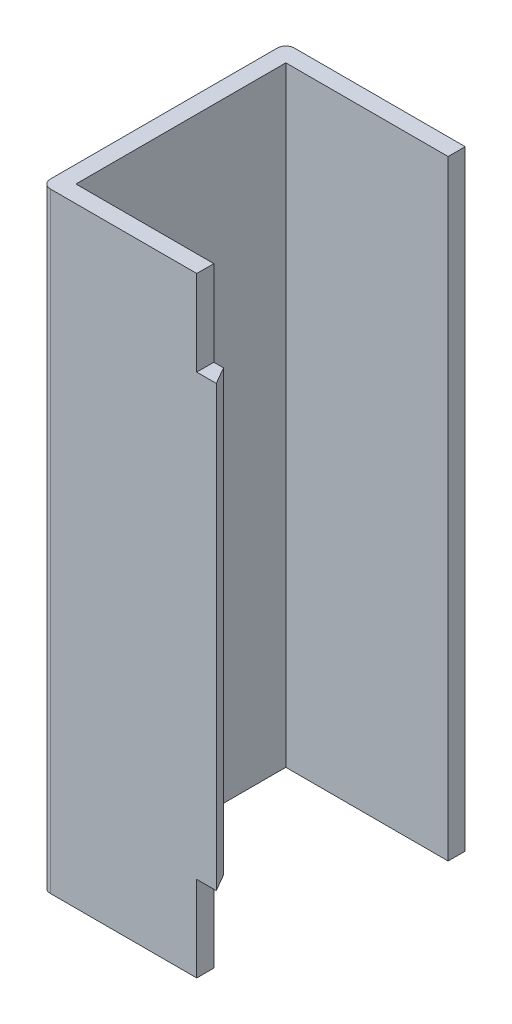
ISO-10303-21;
HEADER;
FILE_DESCRIPTION(('STEP AP214'),'2;1');
FILE_NAME('part.step','',(''),(''),'','','');
FILE_SCHEMA(('AUTOMOTIVE_DESIGN { 1 0 10303 214 1 1 1 1 }'));
ENDSEC;
DATA;
#1=APPLICATION_CONTEXT('core data for automotive mechanical design processes');
#2=APPLICATION_PROTOCOL_DEFINITION('international standard','automotive_design',2000,#1);
#3=PRODUCT_CONTEXT('',#1,'mechanical');
#4=PRODUCT('Part','Part','',(#3));
#5=PRODUCT_RELATED_PRODUCT_CATEGORY('part','',(#4));
#6=PRODUCT_DEFINITION_FORMATION('','',#4);
#7=PRODUCT_DEFINITION_CONTEXT('part definition',#1,'design');
#8=PRODUCT_DEFINITION('design','',#6,#7);
#9=PRODUCT_DEFINITION_SHAPE('','',#8);
#10=(LENGTH_UNIT() NAMED_UNIT(*) SI_UNIT(.MILLI.,.METRE.));
#11=(NAMED_UNIT(*) PLANE_ANGLE_UNIT() SI_UNIT($,.RADIAN.));
#12=(NAMED_UNIT(*) SI_UNIT($,.STERADIAN.) SOLID_ANGLE_UNIT());
#13=UNCERTAINTY_MEASURE_WITH_UNIT(LENGTH_MEASURE(1.E-05),#10,'distance_accuracy_value','');
#14=(GEOMETRIC_REPRESENTATION_CONTEXT(3) GLOBAL_UNCERTAINTY_ASSIGNED_CONTEXT((#13)) GLOBAL_UNIT_ASSIGNED_CONTEXT((#10,
#11,#12)) REPRESENTATION_CONTEXT('',''));
#15=CARTESIAN_POINT('',(0.,0.,0.));
#16=DIRECTION('',(0.,0.,1.));
#17=DIRECTION('',(1.,0.,0.));
#18=AXIS2_PLACEMENT_3D('',#15,#16,#17);
#19=CARTESIAN_POINT('',(-0.6825,-0.45,0.465));
#20=DIRECTION('',(0.,-1.,0.));
#21=DIRECTION('',(0.,0.,-1.));
#22=AXIS2_PLACEMENT_3D('',#19,#20,#21);
#23=PLANE('',#22);
#24=DIRECTION('',(0.50000000000019,0.,0.866025403784329));
#25=VECTOR('',#24,1.);
#26=CARTESIAN_POINT('',(-0.6425,-0.45,0.5));
#27=LINE('',#26,#25);
#28=CARTESIAN_POINT('',(-0.662707259421912,-0.45,0.464999999999949));
#29=VERTEX_POINT('',#28);
#30=CARTESIAN_POINT('',(-0.6425,-0.45,0.5));
#31=VERTEX_POINT('',#30);
#32=EDGE_CURVE('E115',#29,#31,#27,.T.);
#33=ORIENTED_EDGE('',*,*,#32,.T.);
#34=DIRECTION('',(1.,0.,0.));
#35=VECTOR('',#34,1.);
#36=CARTESIAN_POINT('',(-0.816902515723,-0.45,0.5));
#37=LINE('',#36,#35);
#38=CARTESIAN_POINT('',(-0.6825,-0.45,0.5));
#39=VERTEX_POINT('',#38);
#40=EDGE_CURVE('E176',#39,#31,#37,.T.);
#41=ORIENTED_EDGE('',*,*,#40,.F.);
#42=DIRECTION('',(0.,0.,1.));
#43=VECTOR('',#42,1.);
#44=CARTESIAN_POINT('',(-0.6825,-0.45,0.4825));
#45=LINE('',#44,#43);
#46=CARTESIAN_POINT('',(-0.6825,-0.45,0.465));
#47=VERTEX_POINT('',#46);
#48=EDGE_CURVE('E177',#47,#39,#45,.T.);
#49=ORIENTED_EDGE('',*,*,#48,.F.);
#50=DIRECTION('',(1.,0.,0.));
#51=VECTOR('',#50,1.);
#52=CARTESIAN_POINT('',(-0.808201510334,-0.45,0.465));
#53=LINE('',#52,#51);
#54=EDGE_CURVE('E120',#29,#47,#53,.F.);
#55=ORIENTED_EDGE('',*,*,#54,.F.);
#56=EDGE_LOOP('',(#33,#41,#49,#55));
#57=FACE_BOUND('',#56,.T.);
#58=ADVANCED_FACE('F16',(#57),#23,.T.);
#59=CARTESIAN_POINT('',(-0.6425,-0.45,0.5));
#60=DIRECTION('',(-0.866025403784329,0.,0.50000000000019));
#61=DIRECTION('',(0.50000000000019,0.,0.866025403784329));
#62=AXIS2_PLACEMENT_3D('',#59,#60,#61);
#63=PLANE('',#62);
#64=DIRECTION('',(0.,1.,0.));
#65=VECTOR('',#64,1.);
#66=CARTESIAN_POINT('',(-0.662707259422,0.,0.465));
#67=LINE('',#66,#65);
#68=CARTESIAN_POINT('',(-0.662707259421956,0.45,0.465));
#69=VERTEX_POINT('',#68);
#70=EDGE_CURVE('E270',#69,#29,#67,.F.);
#71=ORIENTED_EDGE('',*,*,#70,.F.);
#72=DIRECTION('',(-0.500000000006741,0.,-0.866025403780547));
#73=VECTOR('',#72,1.);
#74=CARTESIAN_POINT('',(-0.6425,0.45,0.5));
#75=LINE('',#74,#73);
#76=CARTESIAN_POINT('',(-0.6425,0.45,0.5));
#77=VERTEX_POINT('',#76);
#78=EDGE_CURVE('E246',#77,#69,#75,.T.);
#79=ORIENTED_EDGE('',*,*,#78,.F.);
#80=DIRECTION('',(0.,-1.,0.));
#81=VECTOR('',#80,1.);
#82=CARTESIAN_POINT('',(-0.6425,0.,0.5));
#83=LINE('',#82,#81);
#84=EDGE_CURVE('E250',#31,#77,#83,.F.);
#85=ORIENTED_EDGE('',*,*,#84,.F.);
#86=ORIENTED_EDGE('',*,*,#32,.F.);
#87=EDGE_LOOP('',(#71,#79,#85,#86));
#88=FACE_BOUND('',#87,.T.);
#89=ADVANCED_FACE('F428',(#88),#63,.F.);
#90=CARTESIAN_POINT('',(-0.6825,0.45,0.5));
#91=DIRECTION('',(0.,1.,0.));
#92=DIRECTION('',(0.,0.,1.));
#93=AXIS2_PLACEMENT_3D('',#90,#91,#92);
#94=PLANE('',#93);
#95=ORIENTED_EDGE('',*,*,#78,.T.);
#96=DIRECTION('',(1.,0.,0.));
#97=VECTOR('',#96,1.);
#98=CARTESIAN_POINT('',(-0.808201510334,0.45,0.465));
#99=LINE('',#98,#97);
#100=CARTESIAN_POINT('',(-0.6825,0.45,0.465));
#101=VERTEX_POINT('',#100);
#102=EDGE_CURVE('E274',#101,#69,#99,.T.);
#103=ORIENTED_EDGE('',*,*,#102,.F.);
#104=DIRECTION('',(0.,0.,1.));
#105=VECTOR('',#104,1.);
#106=CARTESIAN_POINT('',(-0.6825,0.45,0.4825));
#107=LINE('',#106,#105);
#108=CARTESIAN_POINT('',(-0.6825,0.45,0.5));
#109=VERTEX_POINT('',#108);
#110=EDGE_CURVE('E226',#109,#101,#107,.F.);
#111=ORIENTED_EDGE('',*,*,#110,.F.);
#112=DIRECTION('',(1.,0.,0.));
#113=VECTOR('',#112,1.);
#114=CARTESIAN_POINT('',(-0.816902515723,0.45,0.5));
#115=LINE('',#114,#113);
#116=EDGE_CURVE('E141',#77,#109,#115,.F.);
#117=ORIENTED_EDGE('',*,*,#116,.F.);
#118=EDGE_LOOP('',(#95,#103,#111,#117));
#119=FACE_BOUND('',#118,.T.);
#120=ADVANCED_FACE('F420',(#119),#94,.T.);
#121=CARTESIAN_POINT('',(-0.6825,0.,0.4825));
#122=DIRECTION('',(1.,0.,0.));
#123=DIRECTION('',(0.,1.,0.));
#124=AXIS2_PLACEMENT_3D('',#121,#122,#123);
#125=PLANE('',#124);
#126=DIRECTION('',(0.,0.,1.));
#127=VECTOR('',#126,1.);
#128=CARTESIAN_POINT('',(-0.6825,0.625,0.239822058945));
#129=LINE('',#128,#127);
#130=CARTESIAN_POINT('',(-0.6825,0.625,0.5));
#131=VERTEX_POINT('',#130);
#132=CARTESIAN_POINT('',(-0.6825,0.625,0.465));
#133=VERTEX_POINT('',#132);
#134=EDGE_CURVE('E146',#131,#133,#129,.F.);
#135=ORIENTED_EDGE('',*,*,#134,.F.);
#136=DIRECTION('',(0.,-1.,0.));
#137=VECTOR('',#136,1.);
#138=CARTESIAN_POINT('',(-0.6825,0.,0.5));
#139=LINE('',#138,#137);
#140=EDGE_CURVE('E132',#109,#131,#139,.F.);
#141=ORIENTED_EDGE('',*,*,#140,.F.);
#142=ORIENTED_EDGE('',*,*,#110,.T.);
#143=DIRECTION('',(0.,1.,0.));
#144=VECTOR('',#143,1.);
#145=CARTESIAN_POINT('',(-0.6825,0.,0.465));
#146=LINE('',#145,#144);
#147=EDGE_CURVE('E149',#133,#101,#146,.F.);
#148=ORIENTED_EDGE('',*,*,#147,.F.);
#149=EDGE_LOOP('',(#135,#141,#142,#148));
#150=FACE_BOUND('',#149,.T.);
#151=ADVANCED_FACE('F147',(#150),#125,.T.);
#152=CARTESIAN_POINT('',(-0.6325,0.625,0.));
#153=DIRECTION('',(0.,0.,-1.));
#154=DIRECTION('',(-1.,0.,0.));
#155=AXIS2_PLACEMENT_3D('',#152,#153,#154);
#156=PLANE('',#155);
#157=DIRECTION('',(1.,0.,0.));
#158=VECTOR('',#157,1.);
#159=CARTESIAN_POINT('',(-0.880177932085,-0.625,0.));
#160=LINE('',#159,#158);
#161=CARTESIAN_POINT('',(-0.9825,-0.625,0.));
#162=VERTEX_POINT('',#161);
#163=CARTESIAN_POINT('',(-0.6325,-0.625,0.));
#164=VERTEX_POINT('',#163);
#165=EDGE_CURVE('E222',#162,#164,#160,.T.);
#166=ORIENTED_EDGE('',*,*,#165,.F.);
#167=DIRECTION('',(0.,-1.,0.));
#168=VECTOR('',#167,1.);
#169=CARTESIAN_POINT('',(-0.9825,0.625,0.));
#170=LINE('',#169,#168);
#171=CARTESIAN_POINT('',(-0.9825,0.625,0.));
#172=VERTEX_POINT('',#171);
#173=EDGE_CURVE('E58',#162,#172,#170,.F.);
#174=ORIENTED_EDGE('',*,*,#173,.T.);
#175=DIRECTION('',(1.,0.,0.));
#176=VECTOR('',#175,1.);
#177=CARTESIAN_POINT('',(-0.880177932085,0.625,0.));
#178=LINE('',#177,#176);
#179=CARTESIAN_POINT('',(-0.6325,0.625,0.));
#180=VERTEX_POINT('',#179);
#181=EDGE_CURVE('E158',#180,#172,#178,.F.);
#182=ORIENTED_EDGE('',*,*,#181,.F.);
#183=DIRECTION('',(0.,1.,0.));
#184=VECTOR('',#183,1.);
#185=CARTESIAN_POINT('',(-0.6325,0.,0.));
#186=LINE('',#185,#184);
#187=EDGE_CURVE('E217',#180,#164,#186,.F.);
#188=ORIENTED_EDGE('',*,*,#187,.T.);
#189=EDGE_LOOP('',(#166,#174,#182,#188));
#190=FACE_BOUND('',#189,.T.);
#191=ADVANCED_FACE('F404',(#190),#156,.T.);
#192=CARTESIAN_POINT('',(-0.6325,0.,0.0175));
#193=DIRECTION('',(-1.,0.,0.));
#194=DIRECTION('',(0.,0.,1.));
#195=AXIS2_PLACEMENT_3D('',#192,#193,#194);
#196=PLANE('',#195);
#197=ORIENTED_EDGE('',*,*,#187,.F.);
#198=DIRECTION('',(0.,0.,1.));
#199=VECTOR('',#198,1.);
#200=CARTESIAN_POINT('',(-0.6325,0.625,0.239822058945));
#201=LINE('',#200,#199);
#202=CARTESIAN_POINT('',(-0.6325,0.625,0.035));
#203=VERTEX_POINT('',#202);
#204=EDGE_CURVE('E160',#203,#180,#201,.F.);
#205=ORIENTED_EDGE('',*,*,#204,.F.);
#206=DIRECTION('',(0.,1.,0.));
#207=VECTOR('',#206,1.);
#208=CARTESIAN_POINT('',(-0.6325,-0.625,0.035));
#209=LINE('',#208,#207);
#210=CARTESIAN_POINT('',(-0.6325,-0.625,0.035));
#211=VERTEX_POINT('',#210);
#212=EDGE_CURVE('E208',#211,#203,#209,.T.);
#213=ORIENTED_EDGE('',*,*,#212,.F.);
#214=DIRECTION('',(0.,0.,-1.));
#215=VECTOR('',#214,1.);
#216=CARTESIAN_POINT('',(-0.6325,-0.625,0.239822058945));
#217=LINE('',#216,#215);
#218=EDGE_CURVE('E213',#164,#211,#217,.F.);
#219=ORIENTED_EDGE('',*,*,#218,.F.);
#220=EDGE_LOOP('',(#197,#205,#213,#219));
#221=FACE_BOUND('',#220,.T.);
#222=ADVANCED_FACE('F395',(#221),#196,.F.);
#223=CARTESIAN_POINT('',(-0.6325,-0.625,0.035));
#224=DIRECTION('',(0.,0.,1.));
#225=DIRECTION('',(1.,0.,0.));
#226=AXIS2_PLACEMENT_3D('',#223,#224,#225);
#227=PLANE('',#226);
#228=DIRECTION('',(1.,0.,0.));
#229=VECTOR('',#228,1.);
#230=CARTESIAN_POINT('',(-0.880177932085,0.625,0.035));
#231=LINE('',#230,#229);
#232=CARTESIAN_POINT('',(-0.965,0.625,0.035));
#233=VERTEX_POINT('',#232);
#234=EDGE_CURVE('E143',#233,#203,#231,.T.);
#235=ORIENTED_EDGE('',*,*,#234,.F.);
#236=DIRECTION('',(0.,1.,0.));
#237=VECTOR('',#236,1.);
#238=CARTESIAN_POINT('',(-0.965,-0.625,0.035));
#239=LINE('',#238,#237);
#240=CARTESIAN_POINT('',(-0.965,-0.625,0.035));
#241=VERTEX_POINT('',#240);
#242=EDGE_CURVE('E198',#241,#233,#239,.T.);
#243=ORIENTED_EDGE('',*,*,#242,.F.);
#244=DIRECTION('',(1.,0.,0.));
#245=VECTOR('',#244,1.);
#246=CARTESIAN_POINT('',(-0.880177932085,-0.625,0.035));
#247=LINE('',#246,#245);
#248=EDGE_CURVE('E203',#211,#241,#247,.F.);
#249=ORIENTED_EDGE('',*,*,#248,.F.);
#250=ORIENTED_EDGE('',*,*,#212,.T.);
#251=EDGE_LOOP('',(#235,#243,#249,#250));
#252=FACE_BOUND('',#251,.T.);
#253=ADVANCED_FACE('F386',(#252),#227,.T.);
#254=CARTESIAN_POINT('',(-0.965,-0.625,0.0175));
#255=DIRECTION('',(1.,0.,0.));
#256=DIRECTION('',(0.,1.,0.));
#257=AXIS2_PLACEMENT_3D('',#254,#255,#256);
#258=PLANE('',#257);
#259=DIRECTION('',(0.,0.,1.));
#260=VECTOR('',#259,1.);
#261=CARTESIAN_POINT('',(-0.965,0.625,0.239822058945));
#262=LINE('',#261,#260);
#263=CARTESIAN_POINT('',(-0.965,0.625,0.465));
#264=VERTEX_POINT('',#263);
#265=EDGE_CURVE('E172',#264,#233,#262,.F.);
#266=ORIENTED_EDGE('',*,*,#265,.F.);
#267=DIRECTION('',(0.,1.,0.));
#268=VECTOR('',#267,1.);
#269=CARTESIAN_POINT('',(-0.965,0.,0.465));
#270=LINE('',#269,#268);
#271=CARTESIAN_POINT('',(-0.965,-0.625,0.465));
#272=VERTEX_POINT('',#271);
#273=EDGE_CURVE('E67',#272,#264,#270,.T.);
#274=ORIENTED_EDGE('',*,*,#273,.F.);
#275=DIRECTION('',(0.,0.,-1.));
#276=VECTOR('',#275,1.);
#277=CARTESIAN_POINT('',(-0.965,-0.625,0.239822058945));
#278=LINE('',#277,#276);
#279=EDGE_CURVE('E194',#241,#272,#278,.F.);
#280=ORIENTED_EDGE('',*,*,#279,.F.);
#281=ORIENTED_EDGE('',*,*,#242,.T.);
#282=EDGE_LOOP('',(#266,#274,#280,#281));
#283=FACE_BOUND('',#282,.T.);
#284=ADVANCED_FACE('F378',(#283),#258,.T.);
#285=CARTESIAN_POINT('',(-0.808201510334,0.,0.465));
#286=DIRECTION('',(0.,0.,-1.));
#287=DIRECTION('',(0.,1.,0.));
#288=AXIS2_PLACEMENT_3D('',#285,#286,#287);
#289=PLANE('',#288);
#290=ORIENTED_EDGE('',*,*,#54,.T.);
#291=DIRECTION('',(0.,1.,0.));
#292=VECTOR('',#291,1.);
#293=CARTESIAN_POINT('',(-0.6825,0.,0.465));
#294=LINE('',#293,#292);
#295=CARTESIAN_POINT('',(-0.6825,-0.625,0.465));
#296=VERTEX_POINT('',#295);
#297=EDGE_CURVE('E187',#296,#47,#294,.T.);
#298=ORIENTED_EDGE('',*,*,#297,.F.);
#299=DIRECTION('',(1.,0.,0.));
#300=VECTOR('',#299,1.);
#301=CARTESIAN_POINT('',(-0.880177932085,-0.625,0.465));
#302=LINE('',#301,#300);
#303=EDGE_CURVE('E184',#272,#296,#302,.T.);
#304=ORIENTED_EDGE('',*,*,#303,.F.);
#305=ORIENTED_EDGE('',*,*,#273,.T.);
#306=DIRECTION('',(1.,0.,0.));
#307=VECTOR('',#306,1.);
#308=CARTESIAN_POINT('',(-0.880177932085,0.625,0.465));
#309=LINE('',#308,#307);
#310=EDGE_CURVE('E152',#133,#264,#309,.F.);
#311=ORIENTED_EDGE('',*,*,#310,.F.);
#312=ORIENTED_EDGE('',*,*,#147,.T.);
#313=ORIENTED_EDGE('',*,*,#102,.T.);
#314=ORIENTED_EDGE('',*,*,#70,.T.);
#315=EDGE_LOOP('',(#290,#298,#304,#305,#311,#312,#313,#314));
#316=FACE_BOUND('',#315,.T.);
#317=ADVANCED_FACE('F369',(#316),#289,.T.);
#318=CARTESIAN_POINT('',(-0.6825,0.,0.4825));
#319=DIRECTION('',(1.,0.,0.));
#320=DIRECTION('',(0.,1.,0.));
#321=AXIS2_PLACEMENT_3D('',#318,#319,#320);
#322=PLANE('',#321);
#323=ORIENTED_EDGE('',*,*,#48,.T.);
#324=DIRECTION('',(0.,-1.,0.));
#325=VECTOR('',#324,1.);
#326=CARTESIAN_POINT('',(-0.6825,0.,0.5));
#327=LINE('',#326,#325);
#328=CARTESIAN_POINT('',(-0.6825,-0.625,0.5));
#329=VERTEX_POINT('',#328);
#330=EDGE_CURVE('E173',#329,#39,#327,.F.);
#331=ORIENTED_EDGE('',*,*,#330,.F.);
#332=DIRECTION('',(0.,0.,-1.));
#333=VECTOR('',#332,1.);
#334=CARTESIAN_POINT('',(-0.6825,-0.625,0.239822058945));
#335=LINE('',#334,#333);
#336=EDGE_CURVE('E180',#296,#329,#335,.F.);
#337=ORIENTED_EDGE('',*,*,#336,.F.);
#338=ORIENTED_EDGE('',*,*,#297,.T.);
#339=EDGE_LOOP('',(#323,#331,#337,#338));
#340=FACE_BOUND('',#339,.T.);
#341=ADVANCED_FACE('F361',(#340),#322,.T.);
#342=CARTESIAN_POINT('',(-0.816902515723,0.,0.5));
#343=DIRECTION('',(0.,0.,1.));
#344=DIRECTION('',(0.,-1.,0.));
#345=AXIS2_PLACEMENT_3D('',#342,#343,#344);
#346=PLANE('',#345);
#347=ORIENTED_EDGE('',*,*,#116,.T.);
#348=ORIENTED_EDGE('',*,*,#140,.T.);
#349=DIRECTION('',(1.,0.,0.));
#350=VECTOR('',#349,1.);
#351=CARTESIAN_POINT('',(-0.880177932085,0.625,0.5));
#352=LINE('',#351,#350);
#353=CARTESIAN_POINT('',(-0.9825,0.625,0.5));
#354=VERTEX_POINT('',#353);
#355=EDGE_CURVE('E137',#354,#131,#352,.T.);
#356=ORIENTED_EDGE('',*,*,#355,.F.);
#357=DIRECTION('',(0.,-1.,0.));
#358=VECTOR('',#357,1.);
#359=CARTESIAN_POINT('',(-0.9825,0.625,0.5));
#360=LINE('',#359,#358);
#361=CARTESIAN_POINT('',(-0.9825,-0.625,0.5));
#362=VERTEX_POINT('',#361);
#363=EDGE_CURVE('E169',#354,#362,#360,.T.);
#364=ORIENTED_EDGE('',*,*,#363,.T.);
#365=DIRECTION('',(1.,0.,0.));
#366=VECTOR('',#365,1.);
#367=CARTESIAN_POINT('',(-0.880177932085,-0.625,0.5));
#368=LINE('',#367,#366);
#369=EDGE_CURVE('E183',#329,#362,#368,.F.);
#370=ORIENTED_EDGE('',*,*,#369,.F.);
#371=ORIENTED_EDGE('',*,*,#330,.T.);
#372=ORIENTED_EDGE('',*,*,#40,.T.);
#373=ORIENTED_EDGE('',*,*,#84,.T.);
#374=EDGE_LOOP('',(#347,#348,#356,#364,#370,#371,#372,#373));
#375=FACE_BOUND('',#374,.T.);
#376=ADVANCED_FACE('F134',(#375),#346,.T.);
#377=CARTESIAN_POINT('',(-0.880177932085,0.625,0.239822058945));
#378=DIRECTION('',(0.,1.,0.));
#379=DIRECTION('',(0.,0.,1.));
#380=AXIS2_PLACEMENT_3D('',#377,#378,#379);
#381=PLANE('',#380);
#382=ORIENTED_EDGE('',*,*,#310,.T.);
#383=ORIENTED_EDGE('',*,*,#265,.T.);
#384=ORIENTED_EDGE('',*,*,#234,.T.);
#385=ORIENTED_EDGE('',*,*,#204,.T.);
#386=ORIENTED_EDGE('',*,*,#181,.T.);
#387=CARTESIAN_POINT('',(-0.9825,0.625,0.0175));
#388=DIRECTION('',(0.,-1.,0.));
#389=DIRECTION('',(1.,0.,0.));
#390=AXIS2_PLACEMENT_3D('',#387,#388,#389);
#391=CIRCLE('',#390,0.0175);
#392=CARTESIAN_POINT('',(-1.,0.625,0.0175));
#393=VERTEX_POINT('',#392);
#394=EDGE_CURVE('E19',#172,#393,#391,.F.);
#395=ORIENTED_EDGE('',*,*,#394,.T.);
#396=DIRECTION('',(0.,0.,1.));
#397=VECTOR('',#396,1.);
#398=CARTESIAN_POINT('',(-1.,0.625,0.0175));
#399=LINE('',#398,#397);
#400=CARTESIAN_POINT('',(-1.,0.625,0.4825));
#401=VERTEX_POINT('',#400);
#402=EDGE_CURVE('E164',#401,#393,#399,.F.);
#403=ORIENTED_EDGE('',*,*,#402,.F.);
#404=CARTESIAN_POINT('',(-0.9825,0.625,0.4825));
#405=DIRECTION('',(0.,-1.,0.));
#406=DIRECTION('',(0.,0.,-1.));
#407=AXIS2_PLACEMENT_3D('',#404,#405,#406);
#408=CIRCLE('',#407,0.0174999999999989);
#409=EDGE_CURVE('E156',#401,#354,#408,.F.);
#410=ORIENTED_EDGE('',*,*,#409,.T.);
#411=ORIENTED_EDGE('',*,*,#355,.T.);
#412=ORIENTED_EDGE('',*,*,#134,.T.);
#413=EDGE_LOOP('',(#382,#383,#384,#385,#386,#395,#403,#410,#411,#412));
#414=FACE_BOUND('',#413,.T.);
#415=ADVANCED_FACE('F154',(#414),#381,.T.);
#416=CARTESIAN_POINT('',(-0.9825,0.625,0.0175));
#417=DIRECTION('',(0.,-1.,0.));
#418=DIRECTION('',(1.,0.,0.));
#419=AXIS2_PLACEMENT_3D('',#416,#417,#418);
#420=CYLINDRICAL_SURFACE('',#419,0.0175);
#421=DIRECTION('',(0.,-1.,0.));
#422=VECTOR('',#421,1.);
#423=CARTESIAN_POINT('',(-1.,0.625,0.0175));
#424=LINE('',#423,#422);
#425=CARTESIAN_POINT('',(-1.,-0.625,0.0175));
#426=VERTEX_POINT('',#425);
#427=EDGE_CURVE('E299',#393,#426,#424,.T.);
#428=ORIENTED_EDGE('',*,*,#427,.F.);
#429=ORIENTED_EDGE('',*,*,#394,.F.);
#430=ORIENTED_EDGE('',*,*,#173,.F.);
#431=CARTESIAN_POINT('',(-0.9825,-0.625,0.0175));
#432=DIRECTION('',(0.,-1.,0.));
#433=DIRECTION('',(1.,0.,0.));
#434=AXIS2_PLACEMENT_3D('',#431,#432,#433);
#435=CIRCLE('',#434,0.0175);
#436=EDGE_CURVE('E288',#426,#162,#435,.T.);
#437=ORIENTED_EDGE('',*,*,#436,.F.);
#438=EDGE_LOOP('',(#428,#429,#430,#437));
#439=FACE_BOUND('',#438,.T.);
#440=ADVANCED_FACE('F310',(#439),#420,.T.);
#441=CARTESIAN_POINT('',(-0.880177932085,-0.625,0.239822058945));
#442=DIRECTION('',(0.,-1.,0.));
#443=DIRECTION('',(0.,0.,-1.));
#444=AXIS2_PLACEMENT_3D('',#441,#442,#443);
#445=PLANE('',#444);
#446=DIRECTION('',(0.,0.,1.));
#447=VECTOR('',#446,1.);
#448=CARTESIAN_POINT('',(-1.,-0.625,0.0175));
#449=LINE('',#448,#447);
#450=CARTESIAN_POINT('',(-1.,-0.625,0.4825));
#451=VERTEX_POINT('',#450);
#452=EDGE_CURVE('E25',#426,#451,#449,.T.);
#453=ORIENTED_EDGE('',*,*,#452,.F.);
#454=ORIENTED_EDGE('',*,*,#436,.T.);
#455=ORIENTED_EDGE('',*,*,#165,.T.);
#456=ORIENTED_EDGE('',*,*,#218,.T.);
#457=ORIENTED_EDGE('',*,*,#248,.T.);
#458=ORIENTED_EDGE('',*,*,#279,.T.);
#459=ORIENTED_EDGE('',*,*,#303,.T.);
#460=ORIENTED_EDGE('',*,*,#336,.T.);
#461=ORIENTED_EDGE('',*,*,#369,.T.);
#462=CARTESIAN_POINT('',(-0.9825,-0.625,0.4825));
#463=DIRECTION('',(0.,-1.,0.));
#464=DIRECTION('',(0.,0.,-1.));
#465=AXIS2_PLACEMENT_3D('',#462,#463,#464);
#466=CIRCLE('',#465,0.0174999999999989);
#467=EDGE_CURVE('E34',#362,#451,#466,.T.);
#468=ORIENTED_EDGE('',*,*,#467,.T.);
#469=EDGE_LOOP('',(#453,#454,#455,#456,#457,#458,#459,#460,#461,#468));
#470=FACE_BOUND('',#469,.T.);
#471=ADVANCED_FACE('F307',(#470),#445,.T.);
#472=CARTESIAN_POINT('',(-0.9825,0.625,0.4825));
#473=DIRECTION('',(0.,-1.,0.));
#474=DIRECTION('',(0.,0.,-1.));
#475=AXIS2_PLACEMENT_3D('',#472,#473,#474);
#476=CYLINDRICAL_SURFACE('',#475,0.0174999999999989);
#477=ORIENTED_EDGE('',*,*,#363,.F.);
#478=ORIENTED_EDGE('',*,*,#409,.F.);
#479=DIRECTION('',(0.,-1.,0.));
#480=VECTOR('',#479,1.);
#481=CARTESIAN_POINT('',(-1.,0.625,0.4825));
#482=LINE('',#481,#480);
#483=EDGE_CURVE('E10',#451,#401,#482,.F.);
#484=ORIENTED_EDGE('',*,*,#483,.F.);
#485=ORIENTED_EDGE('',*,*,#467,.F.);
#486=EDGE_LOOP('',(#477,#478,#484,#485));
#487=FACE_BOUND('',#486,.T.);
#488=ADVANCED_FACE('F309',(#487),#476,.T.);
#489=CARTESIAN_POINT('',(-1.,0.625,0.0175));
#490=DIRECTION('',(-1.,0.,0.));
#491=DIRECTION('',(0.,-1.,0.));
#492=AXIS2_PLACEMENT_3D('',#489,#490,#491);
#493=PLANE('',#492);
#494=ORIENTED_EDGE('',*,*,#452,.T.);
#495=ORIENTED_EDGE('',*,*,#483,.T.);
#496=ORIENTED_EDGE('',*,*,#402,.T.);
#497=ORIENTED_EDGE('',*,*,#427,.T.);
#498=EDGE_LOOP('',(#494,#495,#496,#497));
#499=FACE_BOUND('',#498,.T.);
#500=ADVANCED_FACE('F304',(#499),#493,.T.);
#501=CLOSED_SHELL('',(#58,#89,#120,#151,#191,#222,#253,#284,#317,#341,#376,#415,#440,#471,#488,#500));
#502=MANIFOLD_SOLID_BREP('B1',#501);
#503=ADVANCED_BREP_SHAPE_REPRESENTATION('',(#18,#502),#14);
#504=SHAPE_DEFINITION_REPRESENTATION(#9,#503);
ENDSEC;
END-ISO-10303-21;
